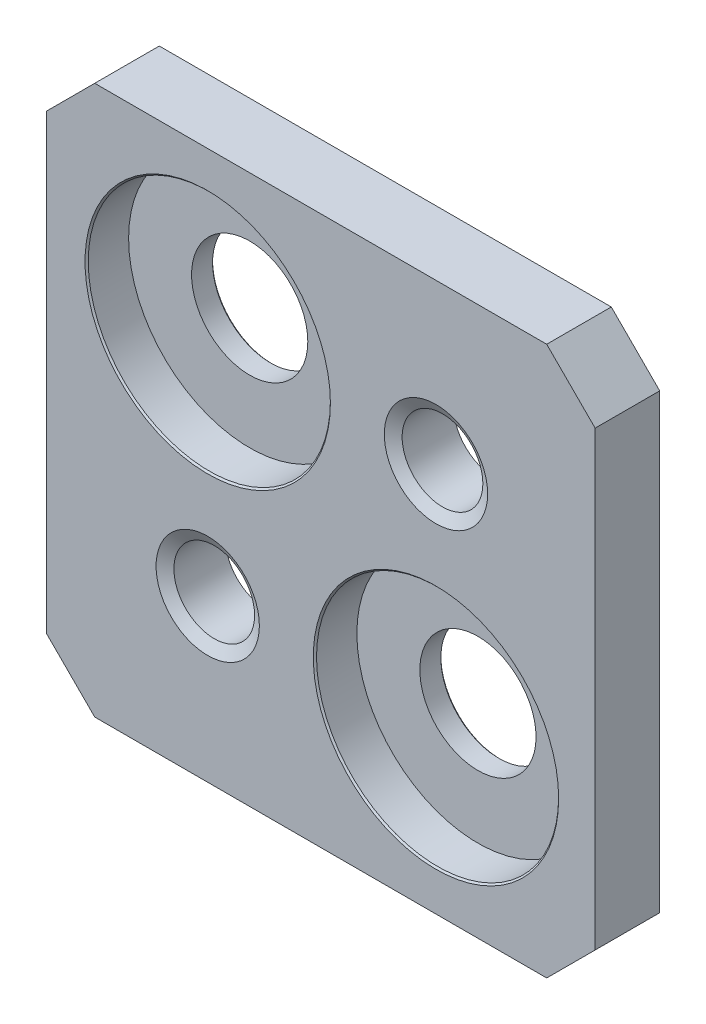
ISO-10303-21;
HEADER;
FILE_DESCRIPTION(('STEP AP214'),'2;1');
FILE_NAME('part.step','',(''),(''),'','','');
FILE_SCHEMA(('AUTOMOTIVE_DESIGN { 1 0 10303 214 1 1 1 1 }'));
ENDSEC;
DATA;
#1=APPLICATION_CONTEXT('core data for automotive mechanical design processes');
#2=APPLICATION_PROTOCOL_DEFINITION('international standard','automotive_design',2000,#1);
#3=PRODUCT_CONTEXT('',#1,'mechanical');
#4=PRODUCT('Part','Part','',(#3));
#5=PRODUCT_RELATED_PRODUCT_CATEGORY('part','',(#4));
#6=PRODUCT_DEFINITION_FORMATION('','',#4);
#7=PRODUCT_DEFINITION_CONTEXT('part definition',#1,'design');
#8=PRODUCT_DEFINITION('design','',#6,#7);
#9=PRODUCT_DEFINITION_SHAPE('','',#8);
#10=(LENGTH_UNIT() NAMED_UNIT(*) SI_UNIT(.MILLI.,.METRE.));
#11=(NAMED_UNIT(*) PLANE_ANGLE_UNIT() SI_UNIT($,.RADIAN.));
#12=(NAMED_UNIT(*) SI_UNIT($,.STERADIAN.) SOLID_ANGLE_UNIT());
#13=UNCERTAINTY_MEASURE_WITH_UNIT(LENGTH_MEASURE(1.E-05),#10,'distance_accuracy_value','');
#14=(GEOMETRIC_REPRESENTATION_CONTEXT(3) GLOBAL_UNCERTAINTY_ASSIGNED_CONTEXT((#13)) GLOBAL_UNIT_ASSIGNED_CONTEXT((#10,
#11,#12)) REPRESENTATION_CONTEXT('',''));
#15=CARTESIAN_POINT('',(0.,0.,0.));
#16=DIRECTION('',(0.,0.,1.));
#17=DIRECTION('',(1.,0.,0.));
#18=AXIS2_PLACEMENT_3D('',#15,#16,#17);
#19=CARTESIAN_POINT('',(0.,17.,2.));
#20=DIRECTION('',(0.,0.,-1.));
#21=DIRECTION('',(-1.,0.,0.));
#22=AXIS2_PLACEMENT_3D('',#19,#20,#21);
#23=PLANE('',#22);
#24=CARTESIAN_POINT('',(5.,12.07,2.));
#25=DIRECTION('',(0.,0.,1.));
#26=DIRECTION('',(1.,0.,0.));
#27=AXIS2_PLACEMENT_3D('',#24,#25,#26);
#28=CIRCLE('',#27,3.8);
#29=CARTESIAN_POINT('',(8.8,12.07,2.));
#30=VERTEX_POINT('',#29);
#31=EDGE_CURVE('E229',#30,#30,#28,.T.);
#32=ORIENTED_EDGE('',*,*,#31,.F.);
#33=EDGE_LOOP('',(#32));
#34=FACE_BOUND('',#33,.T.);
#35=CARTESIAN_POINT('',(5.,5.,2.));
#36=DIRECTION('',(0.,0.,1.));
#37=DIRECTION('',(1.,0.,0.));
#38=AXIS2_PLACEMENT_3D('',#35,#36,#37);
#39=CIRCLE('',#38,1.6);
#40=CARTESIAN_POINT('',(6.6,5.,2.));
#41=VERTEX_POINT('',#40);
#42=EDGE_CURVE('E181',#41,#41,#39,.T.);
#43=ORIENTED_EDGE('',*,*,#42,.F.);
#44=EDGE_LOOP('',(#43));
#45=FACE_BOUND('',#44,.T.);
#46=DIRECTION('',(0.,-1.,0.));
#47=VECTOR('',#46,1.);
#48=CARTESIAN_POINT('',(0.,1.5,2.));
#49=LINE('',#48,#47);
#50=CARTESIAN_POINT('',(0.,15.5,2.));
#51=VERTEX_POINT('',#50);
#52=CARTESIAN_POINT('',(0.,1.5,2.));
#53=VERTEX_POINT('',#52);
#54=EDGE_CURVE('E143',#51,#53,#49,.T.);
#55=ORIENTED_EDGE('',*,*,#54,.T.);
#56=DIRECTION('',(0.707106781186548,-0.707106781186548,0.));
#57=VECTOR('',#56,1.);
#58=CARTESIAN_POINT('',(0.,1.5,2.));
#59=LINE('',#58,#57);
#60=CARTESIAN_POINT('',(1.5,0.,2.));
#61=VERTEX_POINT('',#60);
#62=EDGE_CURVE('E91',#53,#61,#59,.T.);
#63=ORIENTED_EDGE('',*,*,#62,.T.);
#64=DIRECTION('',(1.,0.,0.));
#65=VECTOR('',#64,1.);
#66=CARTESIAN_POINT('',(1.5,0.,2.));
#67=LINE('',#66,#65);
#68=CARTESIAN_POINT('',(15.5,0.,2.));
#69=VERTEX_POINT('',#68);
#70=EDGE_CURVE('E158',#61,#69,#67,.T.);
#71=ORIENTED_EDGE('',*,*,#70,.T.);
#72=DIRECTION('',(0.707106781186547,0.707106781186548,0.));
#73=VECTOR('',#72,1.);
#74=CARTESIAN_POINT('',(15.5,0.,2.));
#75=LINE('',#74,#73);
#76=CARTESIAN_POINT('',(17.,1.5,2.));
#77=VERTEX_POINT('',#76);
#78=EDGE_CURVE('E170',#69,#77,#75,.T.);
#79=ORIENTED_EDGE('',*,*,#78,.T.);
#80=DIRECTION('',(0.,1.,0.));
#81=VECTOR('',#80,1.);
#82=CARTESIAN_POINT('',(17.,1.5,2.));
#83=LINE('',#82,#81);
#84=CARTESIAN_POINT('',(17.,15.5,2.));
#85=VERTEX_POINT('',#84);
#86=EDGE_CURVE('E110',#77,#85,#83,.T.);
#87=ORIENTED_EDGE('',*,*,#86,.T.);
#88=DIRECTION('',(-0.707106781186548,0.707106781186548,0.));
#89=VECTOR('',#88,1.);
#90=CARTESIAN_POINT('',(15.5,17.,2.));
#91=LINE('',#90,#89);
#92=CARTESIAN_POINT('',(15.5,17.,2.));
#93=VERTEX_POINT('',#92);
#94=EDGE_CURVE('E104',#85,#93,#91,.T.);
#95=ORIENTED_EDGE('',*,*,#94,.T.);
#96=DIRECTION('',(-1.,0.,0.));
#97=VECTOR('',#96,1.);
#98=CARTESIAN_POINT('',(1.5,17.,2.));
#99=LINE('',#98,#97);
#100=CARTESIAN_POINT('',(1.5,17.,2.));
#101=VERTEX_POINT('',#100);
#102=EDGE_CURVE('E108',#93,#101,#99,.T.);
#103=ORIENTED_EDGE('',*,*,#102,.T.);
#104=DIRECTION('',(-0.707106781186548,-0.707106781186547,0.));
#105=VECTOR('',#104,1.);
#106=CARTESIAN_POINT('',(0.,15.5,2.));
#107=LINE('',#106,#105);
#108=EDGE_CURVE('E48',#101,#51,#107,.T.);
#109=ORIENTED_EDGE('',*,*,#108,.T.);
#110=EDGE_LOOP('',(#55,#63,#71,#79,#87,#95,#103,#109));
#111=FACE_BOUND('',#110,.T.);
#112=CARTESIAN_POINT('',(12.07,12.07,2.));
#113=DIRECTION('',(0.,0.,1.));
#114=DIRECTION('',(1.,0.,0.));
#115=AXIS2_PLACEMENT_3D('',#112,#113,#114);
#116=CIRCLE('',#115,1.6);
#117=CARTESIAN_POINT('',(13.67,12.07,2.));
#118=VERTEX_POINT('',#117);
#119=EDGE_CURVE('E193',#118,#118,#116,.T.);
#120=ORIENTED_EDGE('',*,*,#119,.F.);
#121=EDGE_LOOP('',(#120));
#122=FACE_BOUND('',#121,.T.);
#123=CARTESIAN_POINT('',(12.07,5.,2.));
#124=DIRECTION('',(0.,0.,1.));
#125=DIRECTION('',(1.,0.,0.));
#126=AXIS2_PLACEMENT_3D('',#123,#124,#125);
#127=CIRCLE('',#126,3.8);
#128=CARTESIAN_POINT('',(15.87,5.,2.));
#129=VERTEX_POINT('',#128);
#130=EDGE_CURVE('E211',#129,#129,#127,.T.);
#131=ORIENTED_EDGE('',*,*,#130,.F.);
#132=EDGE_LOOP('',(#131));
#133=FACE_BOUND('',#132,.T.);
#134=ADVANCED_FACE('F31',(#34,#45,#111,#122,#133),#23,.F.);
#135=CARTESIAN_POINT('',(0.,17.,0.));
#136=DIRECTION('',(0.,0.,-1.));
#137=DIRECTION('',(-1.,0.,0.));
#138=AXIS2_PLACEMENT_3D('',#135,#136,#137);
#139=PLANE('',#138);
#140=CARTESIAN_POINT('',(5.,12.07,0.));
#141=DIRECTION('',(0.,0.,1.));
#142=DIRECTION('',(1.,0.,0.));
#143=AXIS2_PLACEMENT_3D('',#140,#141,#142);
#144=CIRCLE('',#143,1.85);
#145=CARTESIAN_POINT('',(6.85,12.07,0.));
#146=VERTEX_POINT('',#145);
#147=EDGE_CURVE('E232',#146,#146,#144,.T.);
#148=ORIENTED_EDGE('',*,*,#147,.T.);
#149=EDGE_LOOP('',(#148));
#150=FACE_BOUND('',#149,.T.);
#151=CARTESIAN_POINT('',(12.07,5.,0.));
#152=DIRECTION('',(0.,0.,1.));
#153=DIRECTION('',(1.,0.,0.));
#154=AXIS2_PLACEMENT_3D('',#151,#152,#153);
#155=CIRCLE('',#154,1.85);
#156=CARTESIAN_POINT('',(13.92,5.,0.));
#157=VERTEX_POINT('',#156);
#158=EDGE_CURVE('E214',#157,#157,#155,.T.);
#159=ORIENTED_EDGE('',*,*,#158,.T.);
#160=EDGE_LOOP('',(#159));
#161=FACE_BOUND('',#160,.T.);
#162=CARTESIAN_POINT('',(12.07,12.07,0.));
#163=DIRECTION('',(0.,0.,1.));
#164=DIRECTION('',(1.,0.,0.));
#165=AXIS2_PLACEMENT_3D('',#162,#163,#164);
#166=CIRCLE('',#165,1.6);
#167=CARTESIAN_POINT('',(13.67,12.07,0.));
#168=VERTEX_POINT('',#167);
#169=EDGE_CURVE('E196',#168,#168,#166,.T.);
#170=ORIENTED_EDGE('',*,*,#169,.T.);
#171=EDGE_LOOP('',(#170));
#172=FACE_BOUND('',#171,.T.);
#173=CARTESIAN_POINT('',(5.,5.,0.));
#174=DIRECTION('',(0.,0.,1.));
#175=DIRECTION('',(1.,0.,0.));
#176=AXIS2_PLACEMENT_3D('',#173,#174,#175);
#177=CIRCLE('',#176,1.6);
#178=CARTESIAN_POINT('',(6.6,5.,0.));
#179=VERTEX_POINT('',#178);
#180=EDGE_CURVE('E184',#179,#179,#177,.T.);
#181=ORIENTED_EDGE('',*,*,#180,.T.);
#182=EDGE_LOOP('',(#181));
#183=FACE_BOUND('',#182,.T.);
#184=DIRECTION('',(0.,-1.,0.));
#185=VECTOR('',#184,1.);
#186=CARTESIAN_POINT('',(0.,1.5,0.));
#187=LINE('',#186,#185);
#188=CARTESIAN_POINT('',(0.,15.5,0.));
#189=VERTEX_POINT('',#188);
#190=CARTESIAN_POINT('',(0.,1.5,0.));
#191=VERTEX_POINT('',#190);
#192=EDGE_CURVE('E128',#189,#191,#187,.T.);
#193=ORIENTED_EDGE('',*,*,#192,.F.);
#194=DIRECTION('',(-0.707106781186548,-0.707106781186547,0.));
#195=VECTOR('',#194,1.);
#196=CARTESIAN_POINT('',(0.,15.5,0.));
#197=LINE('',#196,#195);
#198=CARTESIAN_POINT('',(1.5,17.,0.));
#199=VERTEX_POINT('',#198);
#200=EDGE_CURVE('E83',#199,#189,#197,.T.);
#201=ORIENTED_EDGE('',*,*,#200,.F.);
#202=DIRECTION('',(-1.,0.,0.));
#203=VECTOR('',#202,1.);
#204=CARTESIAN_POINT('',(1.5,17.,0.));
#205=LINE('',#204,#203);
#206=CARTESIAN_POINT('',(15.5,17.,0.));
#207=VERTEX_POINT('',#206);
#208=EDGE_CURVE('E77',#207,#199,#205,.T.);
#209=ORIENTED_EDGE('',*,*,#208,.F.);
#210=DIRECTION('',(-0.707106781186548,0.707106781186548,0.));
#211=VECTOR('',#210,1.);
#212=CARTESIAN_POINT('',(15.5,17.,0.));
#213=LINE('',#212,#211);
#214=CARTESIAN_POINT('',(17.,15.5,0.));
#215=VERTEX_POINT('',#214);
#216=EDGE_CURVE('E118',#215,#207,#213,.T.);
#217=ORIENTED_EDGE('',*,*,#216,.F.);
#218=DIRECTION('',(0.,1.,0.));
#219=VECTOR('',#218,1.);
#220=CARTESIAN_POINT('',(17.,1.5,0.));
#221=LINE('',#220,#219);
#222=CARTESIAN_POINT('',(17.,1.5,0.));
#223=VERTEX_POINT('',#222);
#224=EDGE_CURVE('E138',#223,#215,#221,.T.);
#225=ORIENTED_EDGE('',*,*,#224,.F.);
#226=DIRECTION('',(0.707106781186547,0.707106781186548,0.));
#227=VECTOR('',#226,1.);
#228=CARTESIAN_POINT('',(15.5,0.,0.));
#229=LINE('',#228,#227);
#230=CARTESIAN_POINT('',(15.5,0.,0.));
#231=VERTEX_POINT('',#230);
#232=EDGE_CURVE('E136',#231,#223,#229,.T.);
#233=ORIENTED_EDGE('',*,*,#232,.F.);
#234=DIRECTION('',(1.,0.,0.));
#235=VECTOR('',#234,1.);
#236=CARTESIAN_POINT('',(1.5,0.,0.));
#237=LINE('',#236,#235);
#238=CARTESIAN_POINT('',(1.5,0.,0.));
#239=VERTEX_POINT('',#238);
#240=EDGE_CURVE('E134',#239,#231,#237,.T.);
#241=ORIENTED_EDGE('',*,*,#240,.F.);
#242=DIRECTION('',(0.707106781186548,-0.707106781186548,0.));
#243=VECTOR('',#242,1.);
#244=CARTESIAN_POINT('',(0.,1.5,0.));
#245=LINE('',#244,#243);
#246=EDGE_CURVE('E131',#191,#239,#245,.T.);
#247=ORIENTED_EDGE('',*,*,#246,.F.);
#248=EDGE_LOOP('',(#193,#201,#209,#217,#225,#233,#241,#247));
#249=FACE_BOUND('',#248,.T.);
#250=ADVANCED_FACE('F162',(#150,#161,#172,#183,#249),#139,.T.);
#251=CARTESIAN_POINT('',(0.,1.5,2.));
#252=DIRECTION('',(1.,0.,0.));
#253=DIRECTION('',(0.,0.,-1.));
#254=AXIS2_PLACEMENT_3D('',#251,#252,#253);
#255=PLANE('',#254);
#256=ORIENTED_EDGE('',*,*,#192,.T.);
#257=DIRECTION('',(0.,0.,-1.));
#258=VECTOR('',#257,1.);
#259=CARTESIAN_POINT('',(0.,1.5,2.));
#260=LINE('',#259,#258);
#261=EDGE_CURVE('E11',#53,#191,#260,.T.);
#262=ORIENTED_EDGE('',*,*,#261,.F.);
#263=ORIENTED_EDGE('',*,*,#54,.F.);
#264=DIRECTION('',(0.,0.,-1.));
#265=VECTOR('',#264,1.);
#266=CARTESIAN_POINT('',(0.,15.5,2.));
#267=LINE('',#266,#265);
#268=EDGE_CURVE('E124',#51,#189,#267,.T.);
#269=ORIENTED_EDGE('',*,*,#268,.T.);
#270=EDGE_LOOP('',(#256,#262,#263,#269));
#271=FACE_BOUND('',#270,.T.);
#272=ADVANCED_FACE('F33',(#271),#255,.F.);
#273=CARTESIAN_POINT('',(0.,1.5,2.));
#274=DIRECTION('',(0.707106781186547,0.707106781186547,0.));
#275=DIRECTION('',(-0.707106781186548,0.707106781186548,0.));
#276=AXIS2_PLACEMENT_3D('',#273,#274,#275);
#277=PLANE('',#276);
#278=ORIENTED_EDGE('',*,*,#246,.T.);
#279=DIRECTION('',(0.,0.,-1.));
#280=VECTOR('',#279,1.);
#281=CARTESIAN_POINT('',(1.5,0.,2.));
#282=LINE('',#281,#280);
#283=EDGE_CURVE('E40',#61,#239,#282,.T.);
#284=ORIENTED_EDGE('',*,*,#283,.F.);
#285=ORIENTED_EDGE('',*,*,#62,.F.);
#286=ORIENTED_EDGE('',*,*,#261,.T.);
#287=EDGE_LOOP('',(#278,#284,#285,#286));
#288=FACE_BOUND('',#287,.T.);
#289=ADVANCED_FACE('F310',(#288),#277,.F.);
#290=CARTESIAN_POINT('',(1.5,0.,2.));
#291=DIRECTION('',(0.,1.,0.));
#292=DIRECTION('',(0.,0.,1.));
#293=AXIS2_PLACEMENT_3D('',#290,#291,#292);
#294=PLANE('',#293);
#295=ORIENTED_EDGE('',*,*,#240,.T.);
#296=DIRECTION('',(0.,0.,-1.));
#297=VECTOR('',#296,1.);
#298=CARTESIAN_POINT('',(15.5,0.,2.));
#299=LINE('',#298,#297);
#300=EDGE_CURVE('E150',#69,#231,#299,.T.);
#301=ORIENTED_EDGE('',*,*,#300,.F.);
#302=ORIENTED_EDGE('',*,*,#70,.F.);
#303=ORIENTED_EDGE('',*,*,#283,.T.);
#304=EDGE_LOOP('',(#295,#301,#302,#303));
#305=FACE_BOUND('',#304,.T.);
#306=ADVANCED_FACE('F156',(#305),#294,.F.);
#307=CARTESIAN_POINT('',(15.5,0.,2.));
#308=DIRECTION('',(-0.707106781186548,0.707106781186547,0.));
#309=DIRECTION('',(-0.707106781186547,-0.707106781186548,0.));
#310=AXIS2_PLACEMENT_3D('',#307,#308,#309);
#311=PLANE('',#310);
#312=ORIENTED_EDGE('',*,*,#232,.T.);
#313=DIRECTION('',(0.,0.,-1.));
#314=VECTOR('',#313,1.);
#315=CARTESIAN_POINT('',(17.,1.5,2.));
#316=LINE('',#315,#314);
#317=EDGE_CURVE('E147',#77,#223,#316,.T.);
#318=ORIENTED_EDGE('',*,*,#317,.F.);
#319=ORIENTED_EDGE('',*,*,#78,.F.);
#320=ORIENTED_EDGE('',*,*,#300,.T.);
#321=EDGE_LOOP('',(#312,#318,#319,#320));
#322=FACE_BOUND('',#321,.T.);
#323=ADVANCED_FACE('F166',(#322),#311,.F.);
#324=CARTESIAN_POINT('',(17.,1.5,2.));
#325=DIRECTION('',(-1.,0.,0.));
#326=DIRECTION('',(0.,0.,1.));
#327=AXIS2_PLACEMENT_3D('',#324,#325,#326);
#328=PLANE('',#327);
#329=ORIENTED_EDGE('',*,*,#224,.T.);
#330=DIRECTION('',(0.,0.,-1.));
#331=VECTOR('',#330,1.);
#332=CARTESIAN_POINT('',(17.,15.5,2.));
#333=LINE('',#332,#331);
#334=EDGE_CURVE('E119',#85,#215,#333,.T.);
#335=ORIENTED_EDGE('',*,*,#334,.F.);
#336=ORIENTED_EDGE('',*,*,#86,.F.);
#337=ORIENTED_EDGE('',*,*,#317,.T.);
#338=EDGE_LOOP('',(#329,#335,#336,#337));
#339=FACE_BOUND('',#338,.T.);
#340=ADVANCED_FACE('F169',(#339),#328,.F.);
#341=CARTESIAN_POINT('',(15.5,17.,2.));
#342=DIRECTION('',(-0.707106781186547,-0.707106781186547,0.));
#343=DIRECTION('',(0.707106781186548,-0.707106781186548,0.));
#344=AXIS2_PLACEMENT_3D('',#341,#342,#343);
#345=PLANE('',#344);
#346=ORIENTED_EDGE('',*,*,#216,.T.);
#347=DIRECTION('',(0.,0.,-1.));
#348=VECTOR('',#347,1.);
#349=CARTESIAN_POINT('',(15.5,17.,2.));
#350=LINE('',#349,#348);
#351=EDGE_CURVE('E115',#93,#207,#350,.T.);
#352=ORIENTED_EDGE('',*,*,#351,.F.);
#353=ORIENTED_EDGE('',*,*,#94,.F.);
#354=ORIENTED_EDGE('',*,*,#334,.T.);
#355=EDGE_LOOP('',(#346,#352,#353,#354));
#356=FACE_BOUND('',#355,.T.);
#357=ADVANCED_FACE('F116',(#356),#345,.F.);
#358=CARTESIAN_POINT('',(1.5,17.,2.));
#359=DIRECTION('',(0.,-1.,0.));
#360=DIRECTION('',(0.,0.,-1.));
#361=AXIS2_PLACEMENT_3D('',#358,#359,#360);
#362=PLANE('',#361);
#363=ORIENTED_EDGE('',*,*,#208,.T.);
#364=DIRECTION('',(0.,0.,-1.));
#365=VECTOR('',#364,1.);
#366=CARTESIAN_POINT('',(1.5,17.,2.));
#367=LINE('',#366,#365);
#368=EDGE_CURVE('E120',#101,#199,#367,.T.);
#369=ORIENTED_EDGE('',*,*,#368,.F.);
#370=ORIENTED_EDGE('',*,*,#102,.F.);
#371=ORIENTED_EDGE('',*,*,#351,.T.);
#372=EDGE_LOOP('',(#363,#369,#370,#371));
#373=FACE_BOUND('',#372,.T.);
#374=ADVANCED_FACE('F122',(#373),#362,.F.);
#375=CARTESIAN_POINT('',(0.,15.5,2.));
#376=DIRECTION('',(0.707106781186547,-0.707106781186548,0.));
#377=DIRECTION('',(0.707106781186548,0.707106781186547,0.));
#378=AXIS2_PLACEMENT_3D('',#375,#376,#377);
#379=PLANE('',#378);
#380=ORIENTED_EDGE('',*,*,#200,.T.);
#381=ORIENTED_EDGE('',*,*,#268,.F.);
#382=ORIENTED_EDGE('',*,*,#108,.F.);
#383=ORIENTED_EDGE('',*,*,#368,.T.);
#384=EDGE_LOOP('',(#380,#381,#382,#383));
#385=FACE_BOUND('',#384,.T.);
#386=ADVANCED_FACE('F294',(#385),#379,.F.);
#387=CARTESIAN_POINT('',(5.,5.,0.20207259421637));
#388=DIRECTION('',(0.,0.,-1.));
#389=DIRECTION('',(-1.,0.,0.));
#390=AXIS2_PLACEMENT_3D('',#387,#388,#389);
#391=CONICAL_SURFACE('',#390,1.25,1.0471975511966);
#392=ORIENTED_EDGE('',*,*,#180,.F.);
#393=EDGE_LOOP('',(#392));
#394=FACE_BOUND('',#393,.T.);
#395=CARTESIAN_POINT('',(5.,5.,0.20207259421637));
#396=DIRECTION('',(0.,0.,1.));
#397=DIRECTION('',(1.,0.,0.));
#398=AXIS2_PLACEMENT_3D('',#395,#396,#397);
#399=CIRCLE('',#398,1.25);
#400=CARTESIAN_POINT('',(6.25,5.,0.20207259421637));
#401=VERTEX_POINT('',#400);
#402=EDGE_CURVE('E132',#401,#401,#399,.T.);
#403=ORIENTED_EDGE('',*,*,#402,.T.);
#404=EDGE_LOOP('',(#403));
#405=FACE_BOUND('',#404,.T.);
#406=ADVANCED_FACE('F287',(#394,#405),#391,.F.);
#407=CARTESIAN_POINT('',(5.,5.,2.));
#408=DIRECTION('',(0.,0.,1.));
#409=DIRECTION('',(1.,0.,0.));
#410=AXIS2_PLACEMENT_3D('',#407,#408,#409);
#411=CYLINDRICAL_SURFACE('',#410,1.25);
#412=ORIENTED_EDGE('',*,*,#402,.F.);
#413=EDGE_LOOP('',(#412));
#414=FACE_BOUND('',#413,.T.);
#415=CARTESIAN_POINT('',(5.,5.,1.79792740578364));
#416=DIRECTION('',(0.,0.,1.));
#417=DIRECTION('',(1.,0.,0.));
#418=AXIS2_PLACEMENT_3D('',#415,#416,#417);
#419=CIRCLE('',#418,1.25);
#420=CARTESIAN_POINT('',(6.25,5.,1.79792740578364));
#421=VERTEX_POINT('',#420);
#422=EDGE_CURVE('E178',#421,#421,#419,.T.);
#423=ORIENTED_EDGE('',*,*,#422,.T.);
#424=EDGE_LOOP('',(#423));
#425=FACE_BOUND('',#424,.T.);
#426=ADVANCED_FACE('F277',(#414,#425),#411,.F.);
#427=CARTESIAN_POINT('',(5.,5.,2.));
#428=DIRECTION('',(0.,0.,1.));
#429=DIRECTION('',(1.,0.,0.));
#430=AXIS2_PLACEMENT_3D('',#427,#428,#429);
#431=CONICAL_SURFACE('',#430,1.6,1.0471975511966);
#432=ORIENTED_EDGE('',*,*,#422,.F.);
#433=EDGE_LOOP('',(#432));
#434=FACE_BOUND('',#433,.T.);
#435=ORIENTED_EDGE('',*,*,#42,.T.);
#436=EDGE_LOOP('',(#435));
#437=FACE_BOUND('',#436,.T.);
#438=ADVANCED_FACE('F274',(#434,#437),#431,.F.);
#439=CARTESIAN_POINT('',(12.07,12.07,0.20207259421637));
#440=DIRECTION('',(0.,0.,-1.));
#441=DIRECTION('',(-1.,0.,0.));
#442=AXIS2_PLACEMENT_3D('',#439,#440,#441);
#443=CONICAL_SURFACE('',#442,1.25,1.0471975511966);
#444=ORIENTED_EDGE('',*,*,#169,.F.);
#445=EDGE_LOOP('',(#444));
#446=FACE_BOUND('',#445,.T.);
#447=CARTESIAN_POINT('',(12.07,12.07,0.20207259421637));
#448=DIRECTION('',(0.,0.,1.));
#449=DIRECTION('',(1.,0.,0.));
#450=AXIS2_PLACEMENT_3D('',#447,#448,#449);
#451=CIRCLE('',#450,1.25);
#452=CARTESIAN_POINT('',(13.32,12.07,0.20207259421637));
#453=VERTEX_POINT('',#452);
#454=EDGE_CURVE('E187',#453,#453,#451,.T.);
#455=ORIENTED_EDGE('',*,*,#454,.T.);
#456=EDGE_LOOP('',(#455));
#457=FACE_BOUND('',#456,.T.);
#458=ADVANCED_FACE('F276',(#446,#457),#443,.F.);
#459=CARTESIAN_POINT('',(12.07,12.07,2.));
#460=DIRECTION('',(0.,0.,1.));
#461=DIRECTION('',(1.,0.,0.));
#462=AXIS2_PLACEMENT_3D('',#459,#460,#461);
#463=CYLINDRICAL_SURFACE('',#462,1.25);
#464=ORIENTED_EDGE('',*,*,#454,.F.);
#465=EDGE_LOOP('',(#464));
#466=FACE_BOUND('',#465,.T.);
#467=CARTESIAN_POINT('',(12.07,12.07,1.79792740578364));
#468=DIRECTION('',(0.,0.,1.));
#469=DIRECTION('',(1.,0.,0.));
#470=AXIS2_PLACEMENT_3D('',#467,#468,#469);
#471=CIRCLE('',#470,1.25);
#472=CARTESIAN_POINT('',(13.32,12.07,1.79792740578364));
#473=VERTEX_POINT('',#472);
#474=EDGE_CURVE('E190',#473,#473,#471,.T.);
#475=ORIENTED_EDGE('',*,*,#474,.T.);
#476=EDGE_LOOP('',(#475));
#477=FACE_BOUND('',#476,.T.);
#478=ADVANCED_FACE('F284',(#466,#477),#463,.F.);
#479=CARTESIAN_POINT('',(12.07,12.07,2.));
#480=DIRECTION('',(0.,0.,1.));
#481=DIRECTION('',(1.,0.,0.));
#482=AXIS2_PLACEMENT_3D('',#479,#480,#481);
#483=CONICAL_SURFACE('',#482,1.6,1.0471975511966);
#484=ORIENTED_EDGE('',*,*,#474,.F.);
#485=EDGE_LOOP('',(#484));
#486=FACE_BOUND('',#485,.T.);
#487=ORIENTED_EDGE('',*,*,#119,.T.);
#488=EDGE_LOOP('',(#487));
#489=FACE_BOUND('',#488,.T.);
#490=ADVANCED_FACE('F336',(#486,#489),#483,.F.);
#491=CARTESIAN_POINT('',(12.07,5.,0.0500000000000001));
#492=DIRECTION('',(0.,0.,-1.));
#493=DIRECTION('',(-1.,0.,0.));
#494=AXIS2_PLACEMENT_3D('',#491,#492,#493);
#495=CONICAL_SURFACE('',#494,1.8,0.785398163397453);
#496=ORIENTED_EDGE('',*,*,#158,.F.);
#497=EDGE_LOOP('',(#496));
#498=FACE_BOUND('',#497,.T.);
#499=CARTESIAN_POINT('',(12.07,5.,0.0500000000000001));
#500=DIRECTION('',(0.,0.,1.));
#501=DIRECTION('',(1.,0.,0.));
#502=AXIS2_PLACEMENT_3D('',#499,#500,#501);
#503=CIRCLE('',#502,1.8);
#504=CARTESIAN_POINT('',(13.87,5.,0.0500000000000001));
#505=VERTEX_POINT('',#504);
#506=EDGE_CURVE('E199',#505,#505,#503,.T.);
#507=ORIENTED_EDGE('',*,*,#506,.T.);
#508=EDGE_LOOP('',(#507));
#509=FACE_BOUND('',#508,.T.);
#510=ADVANCED_FACE('F340',(#498,#509),#495,.F.);
#511=CARTESIAN_POINT('',(12.07,5.,2.));
#512=DIRECTION('',(0.,0.,1.));
#513=DIRECTION('',(1.,0.,0.));
#514=AXIS2_PLACEMENT_3D('',#511,#512,#513);
#515=CYLINDRICAL_SURFACE('',#514,1.8);
#516=ORIENTED_EDGE('',*,*,#506,.F.);
#517=EDGE_LOOP('',(#516));
#518=FACE_BOUND('',#517,.T.);
#519=CARTESIAN_POINT('',(12.07,5.,0.7));
#520=DIRECTION('',(0.,0.,1.));
#521=DIRECTION('',(1.,0.,0.));
#522=AXIS2_PLACEMENT_3D('',#519,#520,#521);
#523=CIRCLE('',#522,1.8);
#524=CARTESIAN_POINT('',(13.87,5.,0.7));
#525=VERTEX_POINT('',#524);
#526=EDGE_CURVE('E202',#525,#525,#523,.T.);
#527=ORIENTED_EDGE('',*,*,#526,.T.);
#528=EDGE_LOOP('',(#527));
#529=FACE_BOUND('',#528,.T.);
#530=ADVANCED_FACE('F424',(#518,#529),#515,.F.);
#531=CARTESIAN_POINT('',(15.82,5.,0.7));
#532=DIRECTION('',(0.,0.,-1.));
#533=DIRECTION('',(-1.,0.,0.));
#534=AXIS2_PLACEMENT_3D('',#531,#532,#533);
#535=PLANE('',#534);
#536=ORIENTED_EDGE('',*,*,#526,.F.);
#537=EDGE_LOOP('',(#536));
#538=FACE_BOUND('',#537,.T.);
#539=CARTESIAN_POINT('',(12.07,5.,0.7));
#540=DIRECTION('',(0.,0.,1.));
#541=DIRECTION('',(1.,0.,0.));
#542=AXIS2_PLACEMENT_3D('',#539,#540,#541);
#543=CIRCLE('',#542,3.75);
#544=CARTESIAN_POINT('',(15.82,5.,0.7));
#545=VERTEX_POINT('',#544);
#546=EDGE_CURVE('E205',#545,#545,#543,.T.);
#547=ORIENTED_EDGE('',*,*,#546,.T.);
#548=EDGE_LOOP('',(#547));
#549=FACE_BOUND('',#548,.T.);
#550=ADVANCED_FACE('F428',(#538,#549),#535,.F.);
#551=CARTESIAN_POINT('',(12.07,5.,2.));
#552=DIRECTION('',(0.,0.,1.));
#553=DIRECTION('',(1.,0.,0.));
#554=AXIS2_PLACEMENT_3D('',#551,#552,#553);
#555=CYLINDRICAL_SURFACE('',#554,3.75);
#556=ORIENTED_EDGE('',*,*,#546,.F.);
#557=EDGE_LOOP('',(#556));
#558=FACE_BOUND('',#557,.T.);
#559=CARTESIAN_POINT('',(12.07,5.,1.95));
#560=DIRECTION('',(0.,0.,1.));
#561=DIRECTION('',(1.,0.,0.));
#562=AXIS2_PLACEMENT_3D('',#559,#560,#561);
#563=CIRCLE('',#562,3.75);
#564=CARTESIAN_POINT('',(15.82,5.,1.95));
#565=VERTEX_POINT('',#564);
#566=EDGE_CURVE('E208',#565,#565,#563,.T.);
#567=ORIENTED_EDGE('',*,*,#566,.T.);
#568=EDGE_LOOP('',(#567));
#569=FACE_BOUND('',#568,.T.);
#570=ADVANCED_FACE('F432',(#558,#569),#555,.F.);
#571=CARTESIAN_POINT('',(12.07,5.,2.));
#572=DIRECTION('',(0.,0.,1.));
#573=DIRECTION('',(1.,0.,0.));
#574=AXIS2_PLACEMENT_3D('',#571,#572,#573);
#575=CONICAL_SURFACE('',#574,3.8,0.785398163397461);
#576=ORIENTED_EDGE('',*,*,#566,.F.);
#577=EDGE_LOOP('',(#576));
#578=FACE_BOUND('',#577,.T.);
#579=ORIENTED_EDGE('',*,*,#130,.T.);
#580=EDGE_LOOP('',(#579));
#581=FACE_BOUND('',#580,.T.);
#582=ADVANCED_FACE('F242',(#578,#581),#575,.F.);
#583=CARTESIAN_POINT('',(5.,12.07,0.0500000000000001));
#584=DIRECTION('',(0.,0.,-1.));
#585=DIRECTION('',(-1.,0.,0.));
#586=AXIS2_PLACEMENT_3D('',#583,#584,#585);
#587=CONICAL_SURFACE('',#586,1.8,0.785398163397453);
#588=ORIENTED_EDGE('',*,*,#147,.F.);
#589=EDGE_LOOP('',(#588));
#590=FACE_BOUND('',#589,.T.);
#591=CARTESIAN_POINT('',(5.,12.07,0.0500000000000001));
#592=DIRECTION('',(0.,0.,1.));
#593=DIRECTION('',(1.,0.,0.));
#594=AXIS2_PLACEMENT_3D('',#591,#592,#593);
#595=CIRCLE('',#594,1.8);
#596=CARTESIAN_POINT('',(6.8,12.07,0.0500000000000001));
#597=VERTEX_POINT('',#596);
#598=EDGE_CURVE('E217',#597,#597,#595,.T.);
#599=ORIENTED_EDGE('',*,*,#598,.T.);
#600=EDGE_LOOP('',(#599));
#601=FACE_BOUND('',#600,.T.);
#602=ADVANCED_FACE('F238',(#590,#601),#587,.F.);
#603=CARTESIAN_POINT('',(5.,12.07,2.));
#604=DIRECTION('',(0.,0.,1.));
#605=DIRECTION('',(1.,0.,0.));
#606=AXIS2_PLACEMENT_3D('',#603,#604,#605);
#607=CYLINDRICAL_SURFACE('',#606,1.8);
#608=ORIENTED_EDGE('',*,*,#598,.F.);
#609=EDGE_LOOP('',(#608));
#610=FACE_BOUND('',#609,.T.);
#611=CARTESIAN_POINT('',(5.,12.07,0.7));
#612=DIRECTION('',(0.,0.,1.));
#613=DIRECTION('',(1.,0.,0.));
#614=AXIS2_PLACEMENT_3D('',#611,#612,#613);
#615=CIRCLE('',#614,1.8);
#616=CARTESIAN_POINT('',(6.8,12.07,0.7));
#617=VERTEX_POINT('',#616);
#618=EDGE_CURVE('E220',#617,#617,#615,.T.);
#619=ORIENTED_EDGE('',*,*,#618,.T.);
#620=EDGE_LOOP('',(#619));
#621=FACE_BOUND('',#620,.T.);
#622=ADVANCED_FACE('F241',(#610,#621),#607,.F.);
#623=CARTESIAN_POINT('',(8.75,12.07,0.7));
#624=DIRECTION('',(0.,0.,-1.));
#625=DIRECTION('',(-1.,0.,0.));
#626=AXIS2_PLACEMENT_3D('',#623,#624,#625);
#627=PLANE('',#626);
#628=ORIENTED_EDGE('',*,*,#618,.F.);
#629=EDGE_LOOP('',(#628));
#630=FACE_BOUND('',#629,.T.);
#631=CARTESIAN_POINT('',(5.,12.07,0.7));
#632=DIRECTION('',(0.,0.,1.));
#633=DIRECTION('',(1.,0.,0.));
#634=AXIS2_PLACEMENT_3D('',#631,#632,#633);
#635=CIRCLE('',#634,3.75);
#636=CARTESIAN_POINT('',(8.75,12.07,0.7));
#637=VERTEX_POINT('',#636);
#638=EDGE_CURVE('E223',#637,#637,#635,.T.);
#639=ORIENTED_EDGE('',*,*,#638,.T.);
#640=EDGE_LOOP('',(#639));
#641=FACE_BOUND('',#640,.T.);
#642=ADVANCED_FACE('F248',(#630,#641),#627,.F.);
#643=CARTESIAN_POINT('',(5.,12.07,2.));
#644=DIRECTION('',(0.,0.,1.));
#645=DIRECTION('',(1.,0.,0.));
#646=AXIS2_PLACEMENT_3D('',#643,#644,#645);
#647=CYLINDRICAL_SURFACE('',#646,3.75);
#648=ORIENTED_EDGE('',*,*,#638,.F.);
#649=EDGE_LOOP('',(#648));
#650=FACE_BOUND('',#649,.T.);
#651=CARTESIAN_POINT('',(5.,12.07,1.95));
#652=DIRECTION('',(0.,0.,1.));
#653=DIRECTION('',(1.,0.,0.));
#654=AXIS2_PLACEMENT_3D('',#651,#652,#653);
#655=CIRCLE('',#654,3.75);
#656=CARTESIAN_POINT('',(8.75,12.07,1.95));
#657=VERTEX_POINT('',#656);
#658=EDGE_CURVE('E226',#657,#657,#655,.T.);
#659=ORIENTED_EDGE('',*,*,#658,.T.);
#660=EDGE_LOOP('',(#659));
#661=FACE_BOUND('',#660,.T.);
#662=ADVANCED_FACE('F254',(#650,#661),#647,.F.);
#663=CARTESIAN_POINT('',(5.,12.07,2.));
#664=DIRECTION('',(0.,0.,1.));
#665=DIRECTION('',(1.,0.,0.));
#666=AXIS2_PLACEMENT_3D('',#663,#664,#665);
#667=CONICAL_SURFACE('',#666,3.8,0.785398163397461);
#668=ORIENTED_EDGE('',*,*,#658,.F.);
#669=EDGE_LOOP('',(#668));
#670=FACE_BOUND('',#669,.T.);
#671=ORIENTED_EDGE('',*,*,#31,.T.);
#672=EDGE_LOOP('',(#671));
#673=FACE_BOUND('',#672,.T.);
#674=ADVANCED_FACE('F260',(#670,#673),#667,.F.);
#675=CLOSED_SHELL('',(#134,#250,#272,#289,#306,#323,#340,#357,#374,#386,#406,#426,#438,#458,
#478,#490,#510,#530,#550,#570,#582,#602,#622,#642,#662,#674));
#676=MANIFOLD_SOLID_BREP('B2',#675);
#677=ADVANCED_BREP_SHAPE_REPRESENTATION('',(#18,#676),#14);
#678=SHAPE_DEFINITION_REPRESENTATION(#9,#677);
ENDSEC;
END-ISO-10303-21;
